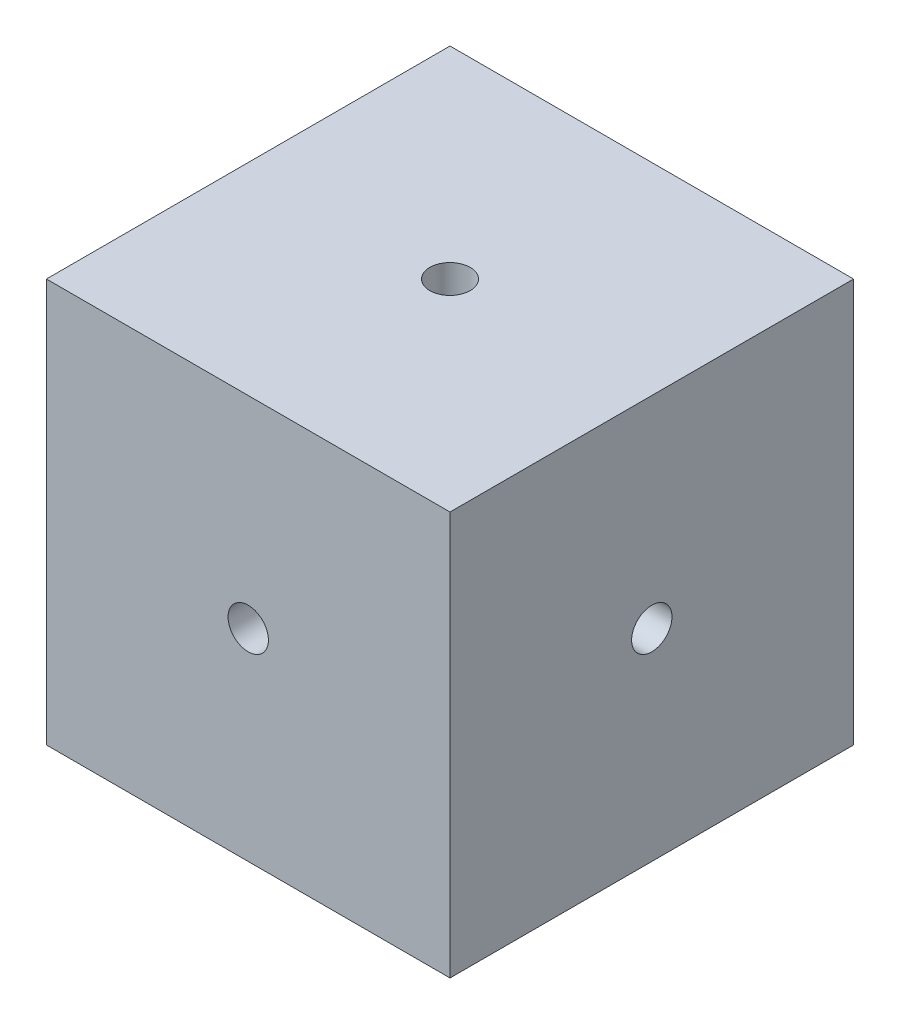
ISO-10303-21;
HEADER;
FILE_DESCRIPTION(('STEP AP214'),'2;1');
FILE_NAME('part.step','',(''),(''),'','','');
FILE_SCHEMA(('AUTOMOTIVE_DESIGN { 1 0 10303 214 1 1 1 1 }'));
ENDSEC;
DATA;
#1=APPLICATION_CONTEXT('core data for automotive mechanical design processes');
#2=APPLICATION_PROTOCOL_DEFINITION('international standard','automotive_design',2000,#1);
#3=PRODUCT_CONTEXT('',#1,'mechanical');
#4=PRODUCT('Part','Part','',(#3));
#5=PRODUCT_RELATED_PRODUCT_CATEGORY('part','',(#4));
#6=PRODUCT_DEFINITION_FORMATION('','',#4);
#7=PRODUCT_DEFINITION_CONTEXT('part definition',#1,'design');
#8=PRODUCT_DEFINITION('design','',#6,#7);
#9=PRODUCT_DEFINITION_SHAPE('','',#8);
#10=(LENGTH_UNIT() NAMED_UNIT(*) SI_UNIT(.MILLI.,.METRE.));
#11=(NAMED_UNIT(*) PLANE_ANGLE_UNIT() SI_UNIT($,.RADIAN.));
#12=(NAMED_UNIT(*) SI_UNIT($,.STERADIAN.) SOLID_ANGLE_UNIT());
#13=UNCERTAINTY_MEASURE_WITH_UNIT(LENGTH_MEASURE(1.E-05),#10,'distance_accuracy_value','');
#14=(GEOMETRIC_REPRESENTATION_CONTEXT(3) GLOBAL_UNCERTAINTY_ASSIGNED_CONTEXT((#13)) GLOBAL_UNIT_ASSIGNED_CONTEXT((#10,
#11,#12)) REPRESENTATION_CONTEXT('',''));
#15=CARTESIAN_POINT('',(0.,0.,0.));
#16=DIRECTION('',(0.,0.,1.));
#17=DIRECTION('',(1.,0.,0.));
#18=AXIS2_PLACEMENT_3D('',#15,#16,#17);
#19=CARTESIAN_POINT('',(0.,-35.,0.));
#20=DIRECTION('',(0.,1.,0.));
#21=DIRECTION('',(0.,0.,1.));
#22=AXIS2_PLACEMENT_3D('',#19,#20,#21);
#23=CYLINDRICAL_SURFACE('',#22,3.5);
#24=CARTESIAN_POINT('',(0.,35.,0.));
#25=DIRECTION('',(0.,1.,0.));
#26=DIRECTION('',(0.,0.,1.));
#27=AXIS2_PLACEMENT_3D('',#24,#25,#26);
#28=CIRCLE('',#27,3.5);
#29=CARTESIAN_POINT('',(0.,35.,3.5));
#30=VERTEX_POINT('',#29);
#31=EDGE_CURVE('E227',#30,#30,#28,.T.);
#32=ORIENTED_EDGE('',*,*,#31,.T.);
#33=EDGE_LOOP('',(#32));
#34=FACE_BOUND('',#33,.T.);
#35=CARTESIAN_POINT('',(0.,0.,0.));
#36=DIRECTION('',(0.,0.707106781186547,-0.707106781186547));
#37=DIRECTION('',(0.,0.707106781186547,0.707106781186547));
#38=AXIS2_PLACEMENT_3D('',#35,#36,#37);
#39=ELLIPSE('',#38,4.94974746830583,3.5);
#40=CARTESIAN_POINT('',(2.47487373415292,2.47487373415292,2.47487373415292));
#41=VERTEX_POINT('',#40);
#42=CARTESIAN_POINT('',(-2.47487373415292,2.47487373415292,2.47487373415292));
#43=VERTEX_POINT('',#42);
#44=EDGE_CURVE('E265',#41,#43,#39,.F.);
#45=ORIENTED_EDGE('',*,*,#44,.T.);
#46=CARTESIAN_POINT('',(0.,0.,0.));
#47=DIRECTION('',(0.707106781186547,0.707106781186547,0.));
#48=DIRECTION('',(-0.707106781186547,0.707106781186547,0.));
#49=AXIS2_PLACEMENT_3D('',#46,#47,#48);
#50=ELLIPSE('',#49,4.94974746830583,3.5);
#51=CARTESIAN_POINT('',(-2.47487373415292,2.47487373415292,-2.47487373415292));
#52=VERTEX_POINT('',#51);
#53=EDGE_CURVE('E210',#43,#52,#50,.F.);
#54=ORIENTED_EDGE('',*,*,#53,.T.);
#55=CARTESIAN_POINT('',(0.,0.,0.));
#56=DIRECTION('',(0.,0.707106781186547,0.707106781186547));
#57=DIRECTION('',(0.,0.707106781186547,-0.707106781186547));
#58=AXIS2_PLACEMENT_3D('',#55,#56,#57);
#59=ELLIPSE('',#58,4.94974746830583,3.5);
#60=CARTESIAN_POINT('',(2.47487373415292,2.47487373415292,-2.47487373415292));
#61=VERTEX_POINT('',#60);
#62=EDGE_CURVE('E274',#52,#61,#59,.F.);
#63=ORIENTED_EDGE('',*,*,#62,.T.);
#64=CARTESIAN_POINT('',(0.,0.,0.));
#65=DIRECTION('',(-0.707106781186547,0.707106781186547,0.));
#66=DIRECTION('',(0.707106781186547,0.707106781186547,0.));
#67=AXIS2_PLACEMENT_3D('',#64,#65,#66);
#68=ELLIPSE('',#67,4.94974746830583,3.5);
#69=EDGE_CURVE('E56',#61,#41,#68,.F.);
#70=ORIENTED_EDGE('',*,*,#69,.T.);
#71=EDGE_LOOP('',(#45,#54,#63,#70));
#72=FACE_BOUND('',#71,.T.);
#73=ADVANCED_FACE('F33',(#34,#72),#23,.F.);
#74=CARTESIAN_POINT('',(35.,35.,35.));
#75=DIRECTION('',(-1.,0.,0.));
#76=DIRECTION('',(0.,0.,1.));
#77=AXIS2_PLACEMENT_3D('',#74,#75,#76);
#78=PLANE('',#77);
#79=CARTESIAN_POINT('',(35.,0.,0.));
#80=DIRECTION('',(1.,0.,0.));
#81=DIRECTION('',(0.,0.,-1.));
#82=AXIS2_PLACEMENT_3D('',#79,#80,#81);
#83=CIRCLE('',#82,3.5);
#84=CARTESIAN_POINT('',(35.,0.,-3.5));
#85=VERTEX_POINT('',#84);
#86=EDGE_CURVE('E192',#85,#85,#83,.T.);
#87=ORIENTED_EDGE('',*,*,#86,.F.);
#88=EDGE_LOOP('',(#87));
#89=FACE_BOUND('',#88,.T.);
#90=DIRECTION('',(0.,0.,-1.));
#91=VECTOR('',#90,1.);
#92=CARTESIAN_POINT('',(35.,-35.,35.));
#93=LINE('',#92,#91);
#94=CARTESIAN_POINT('',(35.,-35.,35.));
#95=VERTEX_POINT('',#94);
#96=CARTESIAN_POINT('',(35.,-35.,-35.));
#97=VERTEX_POINT('',#96);
#98=EDGE_CURVE('E233',#95,#97,#93,.T.);
#99=ORIENTED_EDGE('',*,*,#98,.T.);
#100=DIRECTION('',(0.,-1.,0.));
#101=VECTOR('',#100,1.);
#102=CARTESIAN_POINT('',(35.,35.,-35.));
#103=LINE('',#102,#101);
#104=CARTESIAN_POINT('',(35.,35.,-35.));
#105=VERTEX_POINT('',#104);
#106=EDGE_CURVE('E262',#105,#97,#103,.T.);
#107=ORIENTED_EDGE('',*,*,#106,.F.);
#108=DIRECTION('',(0.,0.,-1.));
#109=VECTOR('',#108,1.);
#110=CARTESIAN_POINT('',(35.,35.,35.));
#111=LINE('',#110,#109);
#112=CARTESIAN_POINT('',(35.,35.,35.));
#113=VERTEX_POINT('',#112);
#114=EDGE_CURVE('E236',#113,#105,#111,.T.);
#115=ORIENTED_EDGE('',*,*,#114,.F.);
#116=DIRECTION('',(0.,-1.,0.));
#117=VECTOR('',#116,1.);
#118=CARTESIAN_POINT('',(35.,35.,35.));
#119=LINE('',#118,#117);
#120=EDGE_CURVE('E246',#113,#95,#119,.T.);
#121=ORIENTED_EDGE('',*,*,#120,.T.);
#122=EDGE_LOOP('',(#99,#107,#115,#121));
#123=FACE_BOUND('',#122,.T.);
#124=ADVANCED_FACE('F35',(#89,#123),#78,.F.);
#125=CARTESIAN_POINT('',(-35.,35.,-35.));
#126=DIRECTION('',(0.,0.,1.));
#127=DIRECTION('',(1.,0.,0.));
#128=AXIS2_PLACEMENT_3D('',#125,#126,#127);
#129=PLANE('',#128);
#130=CARTESIAN_POINT('',(0.,0.,-35.));
#131=DIRECTION('',(0.,0.,1.));
#132=DIRECTION('',(1.,0.,0.));
#133=AXIS2_PLACEMENT_3D('',#130,#131,#132);
#134=CIRCLE('',#133,3.5);
#135=CARTESIAN_POINT('',(3.5,0.,-35.));
#136=VERTEX_POINT('',#135);
#137=EDGE_CURVE('E224',#136,#136,#134,.T.);
#138=ORIENTED_EDGE('',*,*,#137,.T.);
#139=EDGE_LOOP('',(#138));
#140=FACE_BOUND('',#139,.T.);
#141=DIRECTION('',(-1.,0.,0.));
#142=VECTOR('',#141,1.);
#143=CARTESIAN_POINT('',(-35.,-35.,-35.));
#144=LINE('',#143,#142);
#145=CARTESIAN_POINT('',(-35.,-35.,-35.));
#146=VERTEX_POINT('',#145);
#147=EDGE_CURVE('E249',#97,#146,#144,.T.);
#148=ORIENTED_EDGE('',*,*,#147,.T.);
#149=DIRECTION('',(0.,-1.,0.));
#150=VECTOR('',#149,1.);
#151=CARTESIAN_POINT('',(-35.,35.,-35.));
#152=LINE('',#151,#150);
#153=CARTESIAN_POINT('',(-35.,35.,-35.));
#154=VERTEX_POINT('',#153);
#155=EDGE_CURVE('E259',#154,#146,#152,.T.);
#156=ORIENTED_EDGE('',*,*,#155,.F.);
#157=DIRECTION('',(-1.,0.,0.));
#158=VECTOR('',#157,1.);
#159=CARTESIAN_POINT('',(-35.,35.,-35.));
#160=LINE('',#159,#158);
#161=EDGE_CURVE('E239',#105,#154,#160,.T.);
#162=ORIENTED_EDGE('',*,*,#161,.F.);
#163=ORIENTED_EDGE('',*,*,#106,.T.);
#164=EDGE_LOOP('',(#148,#156,#162,#163));
#165=FACE_BOUND('',#164,.T.);
#166=ADVANCED_FACE('F310',(#140,#165),#129,.F.);
#167=CARTESIAN_POINT('',(-35.,35.,35.));
#168=DIRECTION('',(1.,0.,0.));
#169=DIRECTION('',(0.,0.,-1.));
#170=AXIS2_PLACEMENT_3D('',#167,#168,#169);
#171=PLANE('',#170);
#172=CARTESIAN_POINT('',(-35.,0.,0.));
#173=DIRECTION('',(1.,0.,0.));
#174=DIRECTION('',(0.,0.,-1.));
#175=AXIS2_PLACEMENT_3D('',#172,#173,#174);
#176=CIRCLE('',#175,3.5);
#177=CARTESIAN_POINT('',(-35.,0.,-3.5));
#178=VERTEX_POINT('',#177);
#179=EDGE_CURVE('E202',#178,#178,#176,.T.);
#180=ORIENTED_EDGE('',*,*,#179,.T.);
#181=EDGE_LOOP('',(#180));
#182=FACE_BOUND('',#181,.T.);
#183=DIRECTION('',(0.,0.,1.));
#184=VECTOR('',#183,1.);
#185=CARTESIAN_POINT('',(-35.,-35.,35.));
#186=LINE('',#185,#184);
#187=CARTESIAN_POINT('',(-35.,-35.,35.));
#188=VERTEX_POINT('',#187);
#189=EDGE_CURVE('E251',#146,#188,#186,.T.);
#190=ORIENTED_EDGE('',*,*,#189,.T.);
#191=DIRECTION('',(0.,-1.,0.));
#192=VECTOR('',#191,1.);
#193=CARTESIAN_POINT('',(-35.,35.,35.));
#194=LINE('',#193,#192);
#195=CARTESIAN_POINT('',(-35.,35.,35.));
#196=VERTEX_POINT('',#195);
#197=EDGE_CURVE('E256',#196,#188,#194,.T.);
#198=ORIENTED_EDGE('',*,*,#197,.F.);
#199=DIRECTION('',(0.,0.,1.));
#200=VECTOR('',#199,1.);
#201=CARTESIAN_POINT('',(-35.,35.,35.));
#202=LINE('',#201,#200);
#203=EDGE_CURVE('E242',#154,#196,#202,.T.);
#204=ORIENTED_EDGE('',*,*,#203,.F.);
#205=ORIENTED_EDGE('',*,*,#155,.T.);
#206=EDGE_LOOP('',(#190,#198,#204,#205));
#207=FACE_BOUND('',#206,.T.);
#208=ADVANCED_FACE('F334',(#182,#207),#171,.F.);
#209=CARTESIAN_POINT('',(-35.,35.,35.));
#210=DIRECTION('',(0.,0.,-1.));
#211=DIRECTION('',(-1.,0.,0.));
#212=AXIS2_PLACEMENT_3D('',#209,#210,#211);
#213=PLANE('',#212);
#214=CARTESIAN_POINT('',(0.,0.,35.));
#215=DIRECTION('',(0.,0.,1.));
#216=DIRECTION('',(1.,0.,0.));
#217=AXIS2_PLACEMENT_3D('',#214,#215,#216);
#218=CIRCLE('',#217,3.5);
#219=CARTESIAN_POINT('',(3.5,0.,35.));
#220=VERTEX_POINT('',#219);
#221=EDGE_CURVE('E223',#220,#220,#218,.T.);
#222=ORIENTED_EDGE('',*,*,#221,.F.);
#223=EDGE_LOOP('',(#222));
#224=FACE_BOUND('',#223,.T.);
#225=DIRECTION('',(1.,0.,0.));
#226=VECTOR('',#225,1.);
#227=CARTESIAN_POINT('',(-35.,-35.,35.));
#228=LINE('',#227,#226);
#229=EDGE_CURVE('E240',#188,#95,#228,.T.);
#230=ORIENTED_EDGE('',*,*,#229,.T.);
#231=ORIENTED_EDGE('',*,*,#120,.F.);
#232=DIRECTION('',(1.,0.,0.));
#233=VECTOR('',#232,1.);
#234=CARTESIAN_POINT('',(-35.,35.,35.));
#235=LINE('',#234,#233);
#236=EDGE_CURVE('E244',#196,#113,#235,.T.);
#237=ORIENTED_EDGE('',*,*,#236,.F.);
#238=ORIENTED_EDGE('',*,*,#197,.T.);
#239=EDGE_LOOP('',(#230,#231,#237,#238));
#240=FACE_BOUND('',#239,.T.);
#241=ADVANCED_FACE('F328',(#224,#240),#213,.F.);
#242=CARTESIAN_POINT('',(0.,35.,0.));
#243=DIRECTION('',(0.,-1.,0.));
#244=DIRECTION('',(0.,0.,-1.));
#245=AXIS2_PLACEMENT_3D('',#242,#243,#244);
#246=PLANE('',#245);
#247=ORIENTED_EDGE('',*,*,#31,.F.);
#248=EDGE_LOOP('',(#247));
#249=FACE_BOUND('',#248,.T.);
#250=ORIENTED_EDGE('',*,*,#114,.T.);
#251=ORIENTED_EDGE('',*,*,#161,.T.);
#252=ORIENTED_EDGE('',*,*,#203,.T.);
#253=ORIENTED_EDGE('',*,*,#236,.T.);
#254=EDGE_LOOP('',(#250,#251,#252,#253));
#255=FACE_BOUND('',#254,.T.);
#256=ADVANCED_FACE('F321',(#249,#255),#246,.F.);
#257=CARTESIAN_POINT('',(0.,-35.,0.));
#258=DIRECTION('',(0.,-1.,0.));
#259=DIRECTION('',(0.,0.,-1.));
#260=AXIS2_PLACEMENT_3D('',#257,#258,#259);
#261=PLANE('',#260);
#262=DIRECTION('',(0.,0.,-1.));
#263=VECTOR('',#262,1.);
#264=CARTESIAN_POINT('',(-12.5,-35.,-10.5));
#265=LINE('',#264,#263);
#266=CARTESIAN_POINT('',(-12.5,-35.,-10.5));
#267=VERTEX_POINT('',#266);
#268=CARTESIAN_POINT('',(-12.5,-35.,-13.5));
#269=VERTEX_POINT('',#268);
#270=EDGE_CURVE('E48',#267,#269,#265,.T.);
#271=ORIENTED_EDGE('',*,*,#270,.F.);
#272=DIRECTION('',(-1.,0.,0.));
#273=VECTOR('',#272,1.);
#274=CARTESIAN_POINT('',(-12.5,-35.,-10.5));
#275=LINE('',#274,#273);
#276=CARTESIAN_POINT('',(7.30384757729339,-35.,-10.5));
#277=VERTEX_POINT('',#276);
#278=EDGE_CURVE('E160',#277,#267,#275,.T.);
#279=ORIENTED_EDGE('',*,*,#278,.F.);
#280=DIRECTION('',(0.,0.,-1.));
#281=VECTOR('',#280,1.);
#282=CARTESIAN_POINT('',(7.30384757729339,-35.,-10.5));
#283=LINE('',#282,#281);
#284=CARTESIAN_POINT('',(7.30384757729339,-35.,-9.));
#285=VERTEX_POINT('',#284);
#286=EDGE_CURVE('E163',#285,#277,#283,.T.);
#287=ORIENTED_EDGE('',*,*,#286,.F.);
#288=DIRECTION('',(-0.866025403784438,0.,0.500000000000001));
#289=VECTOR('',#288,1.);
#290=CARTESIAN_POINT('',(7.30384757729339,-35.,-9.));
#291=LINE('',#290,#289);
#292=CARTESIAN_POINT('',(12.5,-35.,-12.));
#293=VERTEX_POINT('',#292);
#294=EDGE_CURVE('E185',#293,#285,#291,.T.);
#295=ORIENTED_EDGE('',*,*,#294,.F.);
#296=DIRECTION('',(0.866025403784438,0.,0.500000000000001));
#297=VECTOR('',#296,1.);
#298=CARTESIAN_POINT('',(7.30384757729339,-35.,-15.));
#299=LINE('',#298,#297);
#300=CARTESIAN_POINT('',(7.30384757729339,-35.,-15.));
#301=VERTEX_POINT('',#300);
#302=EDGE_CURVE('E182',#301,#293,#299,.T.);
#303=ORIENTED_EDGE('',*,*,#302,.F.);
#304=DIRECTION('',(0.,0.,-1.));
#305=VECTOR('',#304,1.);
#306=CARTESIAN_POINT('',(7.30384757729339,-35.,-13.5));
#307=LINE('',#306,#305);
#308=CARTESIAN_POINT('',(7.30384757729339,-35.,-13.5));
#309=VERTEX_POINT('',#308);
#310=EDGE_CURVE('E179',#309,#301,#307,.T.);
#311=ORIENTED_EDGE('',*,*,#310,.F.);
#312=DIRECTION('',(1.,0.,0.));
#313=VECTOR('',#312,1.);
#314=CARTESIAN_POINT('',(-12.5,-35.,-13.5));
#315=LINE('',#314,#313);
#316=EDGE_CURVE('E177',#269,#309,#315,.T.);
#317=ORIENTED_EDGE('',*,*,#316,.F.);
#318=EDGE_LOOP('',(#271,#279,#287,#295,#303,#311,#317));
#319=FACE_BOUND('',#318,.T.);
#320=CARTESIAN_POINT('',(0.,-35.,0.));
#321=DIRECTION('',(0.,1.,0.));
#322=DIRECTION('',(0.,0.,1.));
#323=AXIS2_PLACEMENT_3D('',#320,#321,#322);
#324=CIRCLE('',#323,3.5);
#325=CARTESIAN_POINT('',(0.,-35.,3.5));
#326=VERTEX_POINT('',#325);
#327=EDGE_CURVE('E230',#326,#326,#324,.T.);
#328=ORIENTED_EDGE('',*,*,#327,.T.);
#329=EDGE_LOOP('',(#328));
#330=FACE_BOUND('',#329,.T.);
#331=ORIENTED_EDGE('',*,*,#98,.F.);
#332=ORIENTED_EDGE('',*,*,#229,.F.);
#333=ORIENTED_EDGE('',*,*,#189,.F.);
#334=ORIENTED_EDGE('',*,*,#147,.F.);
#335=EDGE_LOOP('',(#331,#332,#333,#334));
#336=FACE_BOUND('',#335,.T.);
#337=ADVANCED_FACE('F314',(#319,#330,#336),#261,.T.);
#338=CARTESIAN_POINT('',(0.,0.,0.));
#339=DIRECTION('',(0.,0.707106781186547,0.707106781186547));
#340=DIRECTION('',(0.,0.707106781186547,-0.707106781186547));
#341=AXIS2_PLACEMENT_3D('',#338,#339,#340);
#342=ELLIPSE('',#341,4.94974746830583,3.5);
#343=CARTESIAN_POINT('',(-2.47487373415292,-2.47487373415292,2.47487373415292));
#344=VERTEX_POINT('',#343);
#345=CARTESIAN_POINT('',(2.47487373415292,-2.47487373415292,2.47487373415292));
#346=VERTEX_POINT('',#345);
#347=EDGE_CURVE('E271',#344,#346,#342,.T.);
#348=ORIENTED_EDGE('',*,*,#347,.T.);
#349=CARTESIAN_POINT('',(0.,0.,0.));
#350=DIRECTION('',(0.707106781186547,0.707106781186547,0.));
#351=DIRECTION('',(-0.707106781186547,0.707106781186547,0.));
#352=AXIS2_PLACEMENT_3D('',#349,#350,#351);
#353=ELLIPSE('',#352,4.94974746830583,3.5);
#354=CARTESIAN_POINT('',(2.47487373415292,-2.47487373415292,-2.47487373415292));
#355=VERTEX_POINT('',#354);
#356=EDGE_CURVE('E216',#346,#355,#353,.T.);
#357=ORIENTED_EDGE('',*,*,#356,.T.);
#358=CARTESIAN_POINT('',(0.,0.,0.));
#359=DIRECTION('',(0.,0.707106781186547,-0.707106781186547));
#360=DIRECTION('',(0.,0.707106781186547,0.707106781186547));
#361=AXIS2_PLACEMENT_3D('',#358,#359,#360);
#362=ELLIPSE('',#361,4.94974746830583,3.5);
#363=CARTESIAN_POINT('',(-2.47487373415292,-2.47487373415292,-2.47487373415292));
#364=VERTEX_POINT('',#363);
#365=EDGE_CURVE('E268',#355,#364,#362,.T.);
#366=ORIENTED_EDGE('',*,*,#365,.T.);
#367=CARTESIAN_POINT('',(0.,0.,0.));
#368=DIRECTION('',(-0.707106781186547,0.707106781186547,0.));
#369=DIRECTION('',(0.707106781186547,0.707106781186547,0.));
#370=AXIS2_PLACEMENT_3D('',#367,#368,#369);
#371=ELLIPSE('',#370,4.94974746830583,3.5);
#372=EDGE_CURVE('E205',#364,#344,#371,.T.);
#373=ORIENTED_EDGE('',*,*,#372,.T.);
#374=EDGE_LOOP('',(#348,#357,#366,#373));
#375=FACE_BOUND('',#374,.T.);
#376=ORIENTED_EDGE('',*,*,#327,.F.);
#377=EDGE_LOOP('',(#376));
#378=FACE_BOUND('',#377,.T.);
#379=ADVANCED_FACE('F283',(#375,#378),#23,.F.);
#380=CARTESIAN_POINT('',(0.,0.,-35.));
#381=DIRECTION('',(0.,0.,1.));
#382=DIRECTION('',(1.,0.,0.));
#383=AXIS2_PLACEMENT_3D('',#380,#381,#382);
#384=CYLINDRICAL_SURFACE('',#383,3.5);
#385=ORIENTED_EDGE('',*,*,#221,.T.);
#386=EDGE_LOOP('',(#385));
#387=FACE_BOUND('',#386,.T.);
#388=ORIENTED_EDGE('',*,*,#347,.F.);
#389=CARTESIAN_POINT('',(0.,0.,0.));
#390=DIRECTION('',(0.707106781186547,0.,0.707106781186547));
#391=DIRECTION('',(-0.707106781186547,0.,0.707106781186547));
#392=AXIS2_PLACEMENT_3D('',#389,#390,#391);
#393=ELLIPSE('',#392,4.94974746830583,3.5);
#394=EDGE_CURVE('E213',#344,#43,#393,.F.);
#395=ORIENTED_EDGE('',*,*,#394,.T.);
#396=ORIENTED_EDGE('',*,*,#44,.F.);
#397=CARTESIAN_POINT('',(0.,0.,0.));
#398=DIRECTION('',(-0.707106781186547,0.,0.707106781186547));
#399=DIRECTION('',(0.707106781186547,0.,0.707106781186547));
#400=AXIS2_PLACEMENT_3D('',#397,#398,#399);
#401=ELLIPSE('',#400,4.94974746830583,3.5);
#402=EDGE_CURVE('E220',#41,#346,#401,.F.);
#403=ORIENTED_EDGE('',*,*,#402,.T.);
#404=EDGE_LOOP('',(#388,#395,#396,#403));
#405=FACE_BOUND('',#404,.T.);
#406=ADVANCED_FACE('F289',(#387,#405),#384,.F.);
#407=ORIENTED_EDGE('',*,*,#137,.F.);
#408=EDGE_LOOP('',(#407));
#409=FACE_BOUND('',#408,.T.);
#410=ORIENTED_EDGE('',*,*,#365,.F.);
#411=CARTESIAN_POINT('',(0.,0.,0.));
#412=DIRECTION('',(0.707106781186547,0.,0.707106781186547));
#413=DIRECTION('',(-0.707106781186547,0.,0.707106781186547));
#414=AXIS2_PLACEMENT_3D('',#411,#412,#413);
#415=ELLIPSE('',#414,4.94974746830583,3.5);
#416=EDGE_CURVE('E11',#355,#61,#415,.T.);
#417=ORIENTED_EDGE('',*,*,#416,.T.);
#418=ORIENTED_EDGE('',*,*,#62,.F.);
#419=CARTESIAN_POINT('',(0.,0.,0.));
#420=DIRECTION('',(-0.707106781186547,0.,0.707106781186547));
#421=DIRECTION('',(0.707106781186547,0.,0.707106781186547));
#422=AXIS2_PLACEMENT_3D('',#419,#420,#421);
#423=ELLIPSE('',#422,4.94974746830583,3.5);
#424=EDGE_CURVE('E41',#52,#364,#423,.T.);
#425=ORIENTED_EDGE('',*,*,#424,.T.);
#426=EDGE_LOOP('',(#410,#417,#418,#425));
#427=FACE_BOUND('',#426,.T.);
#428=ADVANCED_FACE('F280',(#409,#427),#384,.F.);
#429=CARTESIAN_POINT('',(-35.,0.,0.));
#430=DIRECTION('',(1.,0.,0.));
#431=DIRECTION('',(0.,0.,-1.));
#432=AXIS2_PLACEMENT_3D('',#429,#430,#431);
#433=CYLINDRICAL_SURFACE('',#432,3.5);
#434=ORIENTED_EDGE('',*,*,#179,.F.);
#435=EDGE_LOOP('',(#434));
#436=FACE_BOUND('',#435,.T.);
#437=ORIENTED_EDGE('',*,*,#372,.F.);
#438=ORIENTED_EDGE('',*,*,#424,.F.);
#439=ORIENTED_EDGE('',*,*,#53,.F.);
#440=ORIENTED_EDGE('',*,*,#394,.F.);
#441=EDGE_LOOP('',(#437,#438,#439,#440));
#442=FACE_BOUND('',#441,.T.);
#443=ADVANCED_FACE('F291',(#436,#442),#433,.F.);
#444=ORIENTED_EDGE('',*,*,#86,.T.);
#445=EDGE_LOOP('',(#444));
#446=FACE_BOUND('',#445,.T.);
#447=ORIENTED_EDGE('',*,*,#69,.F.);
#448=ORIENTED_EDGE('',*,*,#416,.F.);
#449=ORIENTED_EDGE('',*,*,#356,.F.);
#450=ORIENTED_EDGE('',*,*,#402,.F.);
#451=EDGE_LOOP('',(#447,#448,#449,#450));
#452=FACE_BOUND('',#451,.T.);
#453=ADVANCED_FACE('F286',(#446,#452),#433,.F.);
#454=CARTESIAN_POINT('',(-12.5,-34.,-10.5));
#455=DIRECTION('',(-1.,0.,0.));
#456=DIRECTION('',(0.,0.,1.));
#457=AXIS2_PLACEMENT_3D('',#454,#455,#456);
#458=PLANE('',#457);
#459=ORIENTED_EDGE('',*,*,#270,.T.);
#460=DIRECTION('',(0.,-1.,0.));
#461=VECTOR('',#460,1.);
#462=CARTESIAN_POINT('',(-12.5,-34.,-13.5));
#463=LINE('',#462,#461);
#464=CARTESIAN_POINT('',(-12.5,-34.,-13.5));
#465=VERTEX_POINT('',#464);
#466=EDGE_CURVE('E137',#465,#269,#463,.T.);
#467=ORIENTED_EDGE('',*,*,#466,.F.);
#468=DIRECTION('',(0.,0.,-1.));
#469=VECTOR('',#468,1.);
#470=CARTESIAN_POINT('',(-12.5,-34.,-10.5));
#471=LINE('',#470,#469);
#472=CARTESIAN_POINT('',(-12.5,-34.,-10.5));
#473=VERTEX_POINT('',#472);
#474=EDGE_CURVE('E141',#473,#465,#471,.T.);
#475=ORIENTED_EDGE('',*,*,#474,.F.);
#476=DIRECTION('',(0.,-1.,0.));
#477=VECTOR('',#476,1.);
#478=CARTESIAN_POINT('',(-12.5,-34.,-10.5));
#479=LINE('',#478,#477);
#480=EDGE_CURVE('E190',#473,#267,#479,.T.);
#481=ORIENTED_EDGE('',*,*,#480,.T.);
#482=EDGE_LOOP('',(#459,#467,#475,#481));
#483=FACE_BOUND('',#482,.T.);
#484=ADVANCED_FACE('F139',(#483),#458,.F.);
#485=CARTESIAN_POINT('',(-12.5,-34.,-10.5));
#486=DIRECTION('',(0.,0.,1.));
#487=DIRECTION('',(1.,0.,0.));
#488=AXIS2_PLACEMENT_3D('',#485,#486,#487);
#489=PLANE('',#488);
#490=ORIENTED_EDGE('',*,*,#278,.T.);
#491=ORIENTED_EDGE('',*,*,#480,.F.);
#492=DIRECTION('',(-1.,0.,0.));
#493=VECTOR('',#492,1.);
#494=CARTESIAN_POINT('',(-12.5,-34.,-10.5));
#495=LINE('',#494,#493);
#496=CARTESIAN_POINT('',(7.30384757729339,-34.,-10.5));
#497=VERTEX_POINT('',#496);
#498=EDGE_CURVE('E147',#497,#473,#495,.T.);
#499=ORIENTED_EDGE('',*,*,#498,.F.);
#500=DIRECTION('',(0.,-1.,0.));
#501=VECTOR('',#500,1.);
#502=CARTESIAN_POINT('',(7.30384757729339,-34.,-10.5));
#503=LINE('',#502,#501);
#504=EDGE_CURVE('E193',#497,#277,#503,.T.);
#505=ORIENTED_EDGE('',*,*,#504,.T.);
#506=EDGE_LOOP('',(#490,#491,#499,#505));
#507=FACE_BOUND('',#506,.T.);
#508=ADVANCED_FACE('F412',(#507),#489,.F.);
#509=CARTESIAN_POINT('',(7.30384757729339,-34.,-10.5));
#510=DIRECTION('',(-1.,0.,0.));
#511=DIRECTION('',(0.,0.,1.));
#512=AXIS2_PLACEMENT_3D('',#509,#510,#511);
#513=PLANE('',#512);
#514=ORIENTED_EDGE('',*,*,#286,.T.);
#515=ORIENTED_EDGE('',*,*,#504,.F.);
#516=DIRECTION('',(0.,0.,-1.));
#517=VECTOR('',#516,1.);
#518=CARTESIAN_POINT('',(7.30384757729339,-34.,-10.5));
#519=LINE('',#518,#517);
#520=CARTESIAN_POINT('',(7.30384757729339,-34.,-9.));
#521=VERTEX_POINT('',#520);
#522=EDGE_CURVE('E173',#521,#497,#519,.T.);
#523=ORIENTED_EDGE('',*,*,#522,.F.);
#524=DIRECTION('',(0.,-1.,0.));
#525=VECTOR('',#524,1.);
#526=CARTESIAN_POINT('',(7.30384757729339,-34.,-9.));
#527=LINE('',#526,#525);
#528=EDGE_CURVE('E195',#521,#285,#527,.T.);
#529=ORIENTED_EDGE('',*,*,#528,.T.);
#530=EDGE_LOOP('',(#514,#515,#523,#529));
#531=FACE_BOUND('',#530,.T.);
#532=ADVANCED_FACE('F419',(#531),#513,.F.);
#533=CARTESIAN_POINT('',(7.30384757729339,-34.,-9.));
#534=DIRECTION('',(0.500000000000001,0.,0.866025403784438));
#535=DIRECTION('',(0.866025403784438,0.,-0.500000000000001));
#536=AXIS2_PLACEMENT_3D('',#533,#534,#535);
#537=PLANE('',#536);
#538=ORIENTED_EDGE('',*,*,#294,.T.);
#539=ORIENTED_EDGE('',*,*,#528,.F.);
#540=DIRECTION('',(-0.866025403784438,0.,0.500000000000001));
#541=VECTOR('',#540,1.);
#542=CARTESIAN_POINT('',(7.30384757729339,-34.,-9.));
#543=LINE('',#542,#541);
#544=CARTESIAN_POINT('',(12.5,-34.,-12.));
#545=VERTEX_POINT('',#544);
#546=EDGE_CURVE('E170',#545,#521,#543,.T.);
#547=ORIENTED_EDGE('',*,*,#546,.F.);
#548=DIRECTION('',(0.,-1.,0.));
#549=VECTOR('',#548,1.);
#550=CARTESIAN_POINT('',(12.5,-34.,-12.));
#551=LINE('',#550,#549);
#552=EDGE_CURVE('E197',#545,#293,#551,.T.);
#553=ORIENTED_EDGE('',*,*,#552,.T.);
#554=EDGE_LOOP('',(#538,#539,#547,#553));
#555=FACE_BOUND('',#554,.T.);
#556=ADVANCED_FACE('F428',(#555),#537,.F.);
#557=CARTESIAN_POINT('',(7.30384757729339,-34.,-15.));
#558=DIRECTION('',(0.500000000000001,0.,-0.866025403784438));
#559=DIRECTION('',(-0.866025403784438,0.,-0.500000000000001));
#560=AXIS2_PLACEMENT_3D('',#557,#558,#559);
#561=PLANE('',#560);
#562=ORIENTED_EDGE('',*,*,#302,.T.);
#563=ORIENTED_EDGE('',*,*,#552,.F.);
#564=DIRECTION('',(0.866025403784438,0.,0.500000000000001));
#565=VECTOR('',#564,1.);
#566=CARTESIAN_POINT('',(7.30384757729339,-34.,-15.));
#567=LINE('',#566,#565);
#568=CARTESIAN_POINT('',(7.30384757729339,-34.,-15.));
#569=VERTEX_POINT('',#568);
#570=EDGE_CURVE('E167',#569,#545,#567,.T.);
#571=ORIENTED_EDGE('',*,*,#570,.F.);
#572=DIRECTION('',(0.,-1.,0.));
#573=VECTOR('',#572,1.);
#574=CARTESIAN_POINT('',(7.30384757729339,-34.,-15.));
#575=LINE('',#574,#573);
#576=EDGE_CURVE('E199',#569,#301,#575,.T.);
#577=ORIENTED_EDGE('',*,*,#576,.T.);
#578=EDGE_LOOP('',(#562,#563,#571,#577));
#579=FACE_BOUND('',#578,.T.);
#580=ADVANCED_FACE('F437',(#579),#561,.F.);
#581=CARTESIAN_POINT('',(7.30384757729339,-34.,-13.5));
#582=DIRECTION('',(-1.,0.,0.));
#583=DIRECTION('',(0.,0.,1.));
#584=AXIS2_PLACEMENT_3D('',#581,#582,#583);
#585=PLANE('',#584);
#586=ORIENTED_EDGE('',*,*,#310,.T.);
#587=ORIENTED_EDGE('',*,*,#576,.F.);
#588=DIRECTION('',(0.,0.,-1.));
#589=VECTOR('',#588,1.);
#590=CARTESIAN_POINT('',(7.30384757729339,-34.,-13.5));
#591=LINE('',#590,#589);
#592=CARTESIAN_POINT('',(7.30384757729339,-34.,-13.5));
#593=VERTEX_POINT('',#592);
#594=EDGE_CURVE('E155',#593,#569,#591,.T.);
#595=ORIENTED_EDGE('',*,*,#594,.F.);
#596=DIRECTION('',(0.,-1.,0.));
#597=VECTOR('',#596,1.);
#598=CARTESIAN_POINT('',(7.30384757729339,-34.,-13.5));
#599=LINE('',#598,#597);
#600=EDGE_CURVE('E146',#593,#309,#599,.T.);
#601=ORIENTED_EDGE('',*,*,#600,.T.);
#602=EDGE_LOOP('',(#586,#587,#595,#601));
#603=FACE_BOUND('',#602,.T.);
#604=ADVANCED_FACE('F446',(#603),#585,.F.);
#605=CARTESIAN_POINT('',(-12.5,-34.,-13.5));
#606=DIRECTION('',(0.,0.,-1.));
#607=DIRECTION('',(-1.,0.,0.));
#608=AXIS2_PLACEMENT_3D('',#605,#606,#607);
#609=PLANE('',#608);
#610=ORIENTED_EDGE('',*,*,#316,.T.);
#611=ORIENTED_EDGE('',*,*,#600,.F.);
#612=DIRECTION('',(1.,0.,0.));
#613=VECTOR('',#612,1.);
#614=CARTESIAN_POINT('',(-12.5,-34.,-13.5));
#615=LINE('',#614,#613);
#616=EDGE_CURVE('E150',#465,#593,#615,.T.);
#617=ORIENTED_EDGE('',*,*,#616,.F.);
#618=ORIENTED_EDGE('',*,*,#466,.T.);
#619=EDGE_LOOP('',(#610,#611,#617,#618));
#620=FACE_BOUND('',#619,.T.);
#621=ADVANCED_FACE('F151',(#620),#609,.F.);
#622=CARTESIAN_POINT('',(0.,-34.,0.));
#623=DIRECTION('',(0.,-1.,0.));
#624=DIRECTION('',(0.,0.,-1.));
#625=AXIS2_PLACEMENT_3D('',#622,#623,#624);
#626=PLANE('',#625);
#627=ORIENTED_EDGE('',*,*,#474,.T.);
#628=ORIENTED_EDGE('',*,*,#616,.T.);
#629=ORIENTED_EDGE('',*,*,#594,.T.);
#630=ORIENTED_EDGE('',*,*,#570,.T.);
#631=ORIENTED_EDGE('',*,*,#546,.T.);
#632=ORIENTED_EDGE('',*,*,#522,.T.);
#633=ORIENTED_EDGE('',*,*,#498,.T.);
#634=EDGE_LOOP('',(#627,#628,#629,#630,#631,#632,#633));
#635=FACE_BOUND('',#634,.T.);
#636=ADVANCED_FACE('F157',(#635),#626,.T.);
#637=CLOSED_SHELL('',(#73,#124,#166,#208,#241,#256,#337,#379,#406,#428,#443,#453,#484,#508,#532,
#556,#580,#604,#621,#636));
#638=MANIFOLD_SOLID_BREP('B2',#637);
#639=ADVANCED_BREP_SHAPE_REPRESENTATION('',(#18,#638),#14);
#640=SHAPE_DEFINITION_REPRESENTATION(#9,#639);
ENDSEC;
END-ISO-10303-21;
